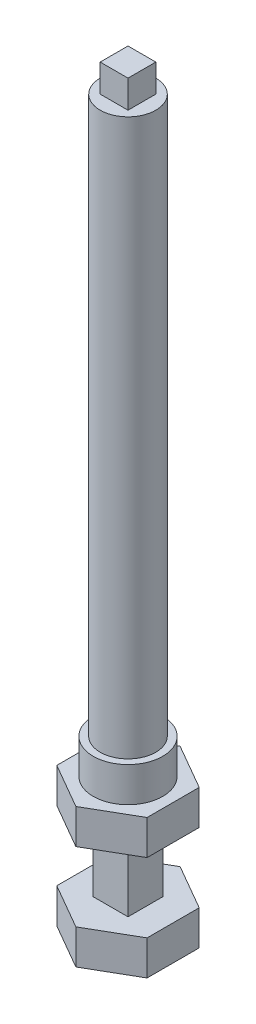
ISO-10303-21;
HEADER;
FILE_DESCRIPTION(('STEP AP214'),'2;1');
FILE_NAME('part.step','',(''),(''),'','','');
FILE_SCHEMA(('AUTOMOTIVE_DESIGN { 1 0 10303 214 1 1 1 1 }'));
ENDSEC;
DATA;
#1=APPLICATION_CONTEXT('core data for automotive mechanical design processes');
#2=APPLICATION_PROTOCOL_DEFINITION('international standard','automotive_design',2000,#1);
#3=PRODUCT_CONTEXT('',#1,'mechanical');
#4=PRODUCT('Part','Part','',(#3));
#5=PRODUCT_RELATED_PRODUCT_CATEGORY('part','',(#4));
#6=PRODUCT_DEFINITION_FORMATION('','',#4);
#7=PRODUCT_DEFINITION_CONTEXT('part definition',#1,'design');
#8=PRODUCT_DEFINITION('design','',#6,#7);
#9=PRODUCT_DEFINITION_SHAPE('','',#8);
#10=(LENGTH_UNIT() NAMED_UNIT(*) SI_UNIT(.MILLI.,.METRE.));
#11=(NAMED_UNIT(*) PLANE_ANGLE_UNIT() SI_UNIT($,.RADIAN.));
#12=(NAMED_UNIT(*) SI_UNIT($,.STERADIAN.) SOLID_ANGLE_UNIT());
#13=UNCERTAINTY_MEASURE_WITH_UNIT(LENGTH_MEASURE(1.E-05),#10,'distance_accuracy_value','');
#14=(GEOMETRIC_REPRESENTATION_CONTEXT(3) GLOBAL_UNCERTAINTY_ASSIGNED_CONTEXT((#13)) GLOBAL_UNIT_ASSIGNED_CONTEXT((#10,
#11,#12)) REPRESENTATION_CONTEXT('',''));
#15=CARTESIAN_POINT('',(0.,0.,0.));
#16=DIRECTION('',(0.,0.,1.));
#17=DIRECTION('',(1.,0.,0.));
#18=AXIS2_PLACEMENT_3D('',#15,#16,#17);
#19=CARTESIAN_POINT('',(-2.5,10.,2.5));
#20=DIRECTION('',(1.,0.,0.));
#21=DIRECTION('',(0.,0.,-1.));
#22=AXIS2_PLACEMENT_3D('',#19,#20,#21);
#23=PLANE('',#22);
#24=DIRECTION('',(0.,0.,1.));
#25=VECTOR('',#24,1.);
#26=CARTESIAN_POINT('',(-2.5,0.,2.5));
#27=LINE('',#26,#25);
#28=CARTESIAN_POINT('',(-2.5,0.,-2.5));
#29=VERTEX_POINT('',#28);
#30=CARTESIAN_POINT('',(-2.5,0.,2.5));
#31=VERTEX_POINT('',#30);
#32=EDGE_CURVE('E303',#29,#31,#27,.T.);
#33=ORIENTED_EDGE('',*,*,#32,.T.);
#34=DIRECTION('',(0.,-1.,0.));
#35=VECTOR('',#34,1.);
#36=CARTESIAN_POINT('',(-2.5,10.,2.5));
#37=LINE('',#36,#35);
#38=CARTESIAN_POINT('',(-2.5,10.,2.5));
#39=VERTEX_POINT('',#38);
#40=EDGE_CURVE('E47',#39,#31,#37,.T.);
#41=ORIENTED_EDGE('',*,*,#40,.F.);
#42=DIRECTION('',(0.,0.,1.));
#43=VECTOR('',#42,1.);
#44=CARTESIAN_POINT('',(-2.5,10.,2.5));
#45=LINE('',#44,#43);
#46=CARTESIAN_POINT('',(-2.5,10.,-2.5));
#47=VERTEX_POINT('',#46);
#48=EDGE_CURVE('E304',#47,#39,#45,.T.);
#49=ORIENTED_EDGE('',*,*,#48,.F.);
#50=DIRECTION('',(0.,-1.,0.));
#51=VECTOR('',#50,1.);
#52=CARTESIAN_POINT('',(-2.5,10.,-2.5));
#53=LINE('',#52,#51);
#54=EDGE_CURVE('E317',#47,#29,#53,.T.);
#55=ORIENTED_EDGE('',*,*,#54,.T.);
#56=EDGE_LOOP('',(#33,#41,#49,#55));
#57=FACE_BOUND('',#56,.T.);
#58=ADVANCED_FACE('F44',(#57),#23,.F.);
#59=CARTESIAN_POINT('',(2.5,10.,2.5));
#60=DIRECTION('',(0.,0.,-1.));
#61=DIRECTION('',(-1.,0.,0.));
#62=AXIS2_PLACEMENT_3D('',#59,#60,#61);
#63=PLANE('',#62);
#64=DIRECTION('',(1.,0.,0.));
#65=VECTOR('',#64,1.);
#66=CARTESIAN_POINT('',(2.5,0.,2.5));
#67=LINE('',#66,#65);
#68=CARTESIAN_POINT('',(2.5,0.,2.5));
#69=VERTEX_POINT('',#68);
#70=EDGE_CURVE('E320',#31,#69,#67,.T.);
#71=ORIENTED_EDGE('',*,*,#70,.T.);
#72=DIRECTION('',(0.,-1.,0.));
#73=VECTOR('',#72,1.);
#74=CARTESIAN_POINT('',(2.5,10.,2.5));
#75=LINE('',#74,#73);
#76=CARTESIAN_POINT('',(2.5,10.,2.5));
#77=VERTEX_POINT('',#76);
#78=EDGE_CURVE('E332',#77,#69,#75,.T.);
#79=ORIENTED_EDGE('',*,*,#78,.F.);
#80=DIRECTION('',(1.,0.,0.));
#81=VECTOR('',#80,1.);
#82=CARTESIAN_POINT('',(2.5,10.,2.5));
#83=LINE('',#82,#81);
#84=EDGE_CURVE('E307',#39,#77,#83,.T.);
#85=ORIENTED_EDGE('',*,*,#84,.F.);
#86=ORIENTED_EDGE('',*,*,#40,.T.);
#87=EDGE_LOOP('',(#71,#79,#85,#86));
#88=FACE_BOUND('',#87,.T.);
#89=ADVANCED_FACE('F339',(#88),#63,.F.);
#90=CARTESIAN_POINT('',(2.5,10.,2.5));
#91=DIRECTION('',(-1.,0.,0.));
#92=DIRECTION('',(0.,0.,1.));
#93=AXIS2_PLACEMENT_3D('',#90,#91,#92);
#94=PLANE('',#93);
#95=DIRECTION('',(0.,0.,-1.));
#96=VECTOR('',#95,1.);
#97=CARTESIAN_POINT('',(2.5,0.,2.5));
#98=LINE('',#97,#96);
#99=CARTESIAN_POINT('',(2.5,0.,-2.5));
#100=VERTEX_POINT('',#99);
#101=EDGE_CURVE('E323',#69,#100,#98,.T.);
#102=ORIENTED_EDGE('',*,*,#101,.T.);
#103=DIRECTION('',(0.,-1.,0.));
#104=VECTOR('',#103,1.);
#105=CARTESIAN_POINT('',(2.5,10.,-2.5));
#106=LINE('',#105,#104);
#107=CARTESIAN_POINT('',(2.5,10.,-2.5));
#108=VERTEX_POINT('',#107);
#109=EDGE_CURVE('E330',#108,#100,#106,.T.);
#110=ORIENTED_EDGE('',*,*,#109,.F.);
#111=DIRECTION('',(0.,0.,-1.));
#112=VECTOR('',#111,1.);
#113=CARTESIAN_POINT('',(2.5,10.,2.5));
#114=LINE('',#113,#112);
#115=EDGE_CURVE('E311',#77,#108,#114,.T.);
#116=ORIENTED_EDGE('',*,*,#115,.F.);
#117=ORIENTED_EDGE('',*,*,#78,.T.);
#118=EDGE_LOOP('',(#102,#110,#116,#117));
#119=FACE_BOUND('',#118,.T.);
#120=ADVANCED_FACE('F348',(#119),#94,.F.);
#121=CARTESIAN_POINT('',(2.5,10.,-2.5));
#122=DIRECTION('',(0.,0.,1.));
#123=DIRECTION('',(1.,0.,0.));
#124=AXIS2_PLACEMENT_3D('',#121,#122,#123);
#125=PLANE('',#124);
#126=DIRECTION('',(-1.,0.,0.));
#127=VECTOR('',#126,1.);
#128=CARTESIAN_POINT('',(2.5,0.,-2.5));
#129=LINE('',#128,#127);
#130=EDGE_CURVE('E308',#100,#29,#129,.T.);
#131=ORIENTED_EDGE('',*,*,#130,.T.);
#132=ORIENTED_EDGE('',*,*,#54,.F.);
#133=DIRECTION('',(-1.,0.,0.));
#134=VECTOR('',#133,1.);
#135=CARTESIAN_POINT('',(2.5,10.,-2.5));
#136=LINE('',#135,#134);
#137=EDGE_CURVE('E314',#108,#47,#136,.T.);
#138=ORIENTED_EDGE('',*,*,#137,.F.);
#139=ORIENTED_EDGE('',*,*,#109,.T.);
#140=EDGE_LOOP('',(#131,#132,#138,#139));
#141=FACE_BOUND('',#140,.T.);
#142=ADVANCED_FACE('F346',(#141),#125,.F.);
#143=CARTESIAN_POINT('',(6.49519052838328,-5.,3.75));
#144=DIRECTION('',(-0.5,0.,-0.866025403784439));
#145=DIRECTION('',(-0.866025403784439,0.,0.5));
#146=AXIS2_PLACEMENT_3D('',#143,#144,#145);
#147=PLANE('',#146);
#148=DIRECTION('',(-0.866025403784439,0.,0.5));
#149=VECTOR('',#148,1.);
#150=CARTESIAN_POINT('',(6.49519052838328,0.,3.75));
#151=LINE('',#150,#149);
#152=CARTESIAN_POINT('',(6.49519052838328,0.,3.75));
#153=VERTEX_POINT('',#152);
#154=CARTESIAN_POINT('',(0.,0.,7.5));
#155=VERTEX_POINT('',#154);
#156=EDGE_CURVE('E259',#153,#155,#151,.T.);
#157=ORIENTED_EDGE('',*,*,#156,.T.);
#158=DIRECTION('',(0.,1.,0.));
#159=VECTOR('',#158,1.);
#160=CARTESIAN_POINT('',(0.,-5.,7.5));
#161=LINE('',#160,#159);
#162=CARTESIAN_POINT('',(0.,-5.,7.5));
#163=VERTEX_POINT('',#162);
#164=EDGE_CURVE('E300',#163,#155,#161,.T.);
#165=ORIENTED_EDGE('',*,*,#164,.F.);
#166=DIRECTION('',(-0.866025403784439,0.,0.5));
#167=VECTOR('',#166,1.);
#168=CARTESIAN_POINT('',(6.49519052838328,-5.,3.75));
#169=LINE('',#168,#167);
#170=CARTESIAN_POINT('',(6.49519052838328,-5.,3.75));
#171=VERTEX_POINT('',#170);
#172=EDGE_CURVE('E260',#171,#163,#169,.T.);
#173=ORIENTED_EDGE('',*,*,#172,.F.);
#174=DIRECTION('',(0.,1.,0.));
#175=VECTOR('',#174,1.);
#176=CARTESIAN_POINT('',(6.49519052838328,-5.,3.75));
#177=LINE('',#176,#175);
#178=EDGE_CURVE('E274',#171,#153,#177,.T.);
#179=ORIENTED_EDGE('',*,*,#178,.T.);
#180=EDGE_LOOP('',(#157,#165,#173,#179));
#181=FACE_BOUND('',#180,.T.);
#182=ADVANCED_FACE('F378',(#181),#147,.F.);
#183=CARTESIAN_POINT('',(0.,-5.,7.5));
#184=DIRECTION('',(0.5,0.,-0.866025403784439));
#185=DIRECTION('',(-0.866025403784439,0.,-0.5));
#186=AXIS2_PLACEMENT_3D('',#183,#184,#185);
#187=PLANE('',#186);
#188=DIRECTION('',(-0.866025403784439,0.,-0.5));
#189=VECTOR('',#188,1.);
#190=CARTESIAN_POINT('',(0.,0.,7.5));
#191=LINE('',#190,#189);
#192=CARTESIAN_POINT('',(-6.49519052838329,0.,3.75));
#193=VERTEX_POINT('',#192);
#194=EDGE_CURVE('E277',#155,#193,#191,.T.);
#195=ORIENTED_EDGE('',*,*,#194,.T.);
#196=DIRECTION('',(0.,1.,0.));
#197=VECTOR('',#196,1.);
#198=CARTESIAN_POINT('',(-6.49519052838329,-5.,3.75));
#199=LINE('',#198,#197);
#200=CARTESIAN_POINT('',(-6.49519052838329,-5.,3.75));
#201=VERTEX_POINT('',#200);
#202=EDGE_CURVE('E297',#201,#193,#199,.T.);
#203=ORIENTED_EDGE('',*,*,#202,.F.);
#204=DIRECTION('',(-0.866025403784439,0.,-0.5));
#205=VECTOR('',#204,1.);
#206=CARTESIAN_POINT('',(0.,-5.,7.5));
#207=LINE('',#206,#205);
#208=EDGE_CURVE('E263',#163,#201,#207,.T.);
#209=ORIENTED_EDGE('',*,*,#208,.F.);
#210=ORIENTED_EDGE('',*,*,#164,.T.);
#211=EDGE_LOOP('',(#195,#203,#209,#210));
#212=FACE_BOUND('',#211,.T.);
#213=ADVANCED_FACE('F381',(#212),#187,.F.);
#214=CARTESIAN_POINT('',(-6.49519052838329,-5.,3.75));
#215=DIRECTION('',(1.,0.,0.));
#216=DIRECTION('',(0.,0.,-1.));
#217=AXIS2_PLACEMENT_3D('',#214,#215,#216);
#218=PLANE('',#217);
#219=DIRECTION('',(0.,0.,-1.));
#220=VECTOR('',#219,1.);
#221=CARTESIAN_POINT('',(-6.49519052838329,0.,3.75));
#222=LINE('',#221,#220);
#223=CARTESIAN_POINT('',(-6.49519052838329,0.,-3.75));
#224=VERTEX_POINT('',#223);
#225=EDGE_CURVE('E279',#193,#224,#222,.T.);
#226=ORIENTED_EDGE('',*,*,#225,.T.);
#227=DIRECTION('',(0.,1.,0.));
#228=VECTOR('',#227,1.);
#229=CARTESIAN_POINT('',(-6.49519052838329,-5.,-3.75));
#230=LINE('',#229,#228);
#231=CARTESIAN_POINT('',(-6.49519052838329,-5.,-3.75));
#232=VERTEX_POINT('',#231);
#233=EDGE_CURVE('E294',#232,#224,#230,.T.);
#234=ORIENTED_EDGE('',*,*,#233,.F.);
#235=DIRECTION('',(0.,0.,-1.));
#236=VECTOR('',#235,1.);
#237=CARTESIAN_POINT('',(-6.49519052838329,-5.,3.75));
#238=LINE('',#237,#236);
#239=EDGE_CURVE('E266',#201,#232,#238,.T.);
#240=ORIENTED_EDGE('',*,*,#239,.F.);
#241=ORIENTED_EDGE('',*,*,#202,.T.);
#242=EDGE_LOOP('',(#226,#234,#240,#241));
#243=FACE_BOUND('',#242,.T.);
#244=ADVANCED_FACE('F385',(#243),#218,.F.);
#245=CARTESIAN_POINT('',(-6.49519052838329,-5.,-3.75));
#246=DIRECTION('',(0.5,0.,0.866025403784439));
#247=DIRECTION('',(0.866025403784439,0.,-0.5));
#248=AXIS2_PLACEMENT_3D('',#245,#246,#247);
#249=PLANE('',#248);
#250=DIRECTION('',(0.866025403784439,0.,-0.5));
#251=VECTOR('',#250,1.);
#252=CARTESIAN_POINT('',(-6.49519052838329,0.,-3.75));
#253=LINE('',#252,#251);
#254=CARTESIAN_POINT('',(0.,0.,-7.5));
#255=VERTEX_POINT('',#254);
#256=EDGE_CURVE('E281',#224,#255,#253,.T.);
#257=ORIENTED_EDGE('',*,*,#256,.T.);
#258=DIRECTION('',(0.,1.,0.));
#259=VECTOR('',#258,1.);
#260=CARTESIAN_POINT('',(0.,-5.,-7.5));
#261=LINE('',#260,#259);
#262=CARTESIAN_POINT('',(0.,-5.,-7.5));
#263=VERTEX_POINT('',#262);
#264=EDGE_CURVE('E291',#263,#255,#261,.T.);
#265=ORIENTED_EDGE('',*,*,#264,.F.);
#266=DIRECTION('',(0.866025403784439,0.,-0.5));
#267=VECTOR('',#266,1.);
#268=CARTESIAN_POINT('',(-6.49519052838329,-5.,-3.75));
#269=LINE('',#268,#267);
#270=EDGE_CURVE('E268',#232,#263,#269,.T.);
#271=ORIENTED_EDGE('',*,*,#270,.F.);
#272=ORIENTED_EDGE('',*,*,#233,.T.);
#273=EDGE_LOOP('',(#257,#265,#271,#272));
#274=FACE_BOUND('',#273,.T.);
#275=ADVANCED_FACE('F389',(#274),#249,.F.);
#276=CARTESIAN_POINT('',(0.,-5.,-7.5));
#277=DIRECTION('',(-0.5,0.,0.866025403784439));
#278=DIRECTION('',(0.866025403784439,0.,0.5));
#279=AXIS2_PLACEMENT_3D('',#276,#277,#278);
#280=PLANE('',#279);
#281=DIRECTION('',(0.866025403784439,0.,0.5));
#282=VECTOR('',#281,1.);
#283=CARTESIAN_POINT('',(0.,0.,-7.5));
#284=LINE('',#283,#282);
#285=CARTESIAN_POINT('',(6.49519052838329,0.,-3.75));
#286=VERTEX_POINT('',#285);
#287=EDGE_CURVE('E283',#255,#286,#284,.T.);
#288=ORIENTED_EDGE('',*,*,#287,.T.);
#289=DIRECTION('',(0.,1.,0.));
#290=VECTOR('',#289,1.);
#291=CARTESIAN_POINT('',(6.49519052838329,-5.,-3.75));
#292=LINE('',#291,#290);
#293=CARTESIAN_POINT('',(6.49519052838329,-5.,-3.75));
#294=VERTEX_POINT('',#293);
#295=EDGE_CURVE('E288',#294,#286,#292,.T.);
#296=ORIENTED_EDGE('',*,*,#295,.F.);
#297=DIRECTION('',(0.866025403784439,0.,0.5));
#298=VECTOR('',#297,1.);
#299=CARTESIAN_POINT('',(0.,-5.,-7.5));
#300=LINE('',#299,#298);
#301=EDGE_CURVE('E270',#263,#294,#300,.T.);
#302=ORIENTED_EDGE('',*,*,#301,.F.);
#303=ORIENTED_EDGE('',*,*,#264,.T.);
#304=EDGE_LOOP('',(#288,#296,#302,#303));
#305=FACE_BOUND('',#304,.T.);
#306=ADVANCED_FACE('F393',(#305),#280,.F.);
#307=CARTESIAN_POINT('',(6.49519052838329,-5.,-3.75));
#308=DIRECTION('',(-1.,0.,0.));
#309=DIRECTION('',(0.,0.,1.));
#310=AXIS2_PLACEMENT_3D('',#307,#308,#309);
#311=PLANE('',#310);
#312=DIRECTION('',(0.,0.,1.));
#313=VECTOR('',#312,1.);
#314=CARTESIAN_POINT('',(6.49519052838329,0.,-3.75));
#315=LINE('',#314,#313);
#316=EDGE_CURVE('E264',#286,#153,#315,.T.);
#317=ORIENTED_EDGE('',*,*,#316,.T.);
#318=ORIENTED_EDGE('',*,*,#178,.F.);
#319=DIRECTION('',(0.,0.,1.));
#320=VECTOR('',#319,1.);
#321=CARTESIAN_POINT('',(6.49519052838329,-5.,-3.75));
#322=LINE('',#321,#320);
#323=EDGE_CURVE('E272',#294,#171,#322,.T.);
#324=ORIENTED_EDGE('',*,*,#323,.F.);
#325=ORIENTED_EDGE('',*,*,#295,.T.);
#326=EDGE_LOOP('',(#317,#318,#324,#325));
#327=FACE_BOUND('',#326,.T.);
#328=ADVANCED_FACE('F397',(#327),#311,.F.);
#329=CARTESIAN_POINT('',(0.,-5.,0.));
#330=DIRECTION('',(0.,-1.,0.));
#331=DIRECTION('',(0.,0.,-1.));
#332=AXIS2_PLACEMENT_3D('',#329,#330,#331);
#333=PLANE('',#332);
#334=ORIENTED_EDGE('',*,*,#172,.T.);
#335=ORIENTED_EDGE('',*,*,#208,.T.);
#336=ORIENTED_EDGE('',*,*,#239,.T.);
#337=ORIENTED_EDGE('',*,*,#270,.T.);
#338=ORIENTED_EDGE('',*,*,#301,.T.);
#339=ORIENTED_EDGE('',*,*,#323,.T.);
#340=EDGE_LOOP('',(#334,#335,#336,#337,#338,#339));
#341=FACE_BOUND('',#340,.T.);
#342=ADVANCED_FACE('F362',(#341),#333,.T.);
#343=CARTESIAN_POINT('',(0.,0.,0.));
#344=DIRECTION('',(0.,-1.,0.));
#345=DIRECTION('',(0.,0.,-1.));
#346=AXIS2_PLACEMENT_3D('',#343,#344,#345);
#347=PLANE('',#346);
#348=ORIENTED_EDGE('',*,*,#32,.F.);
#349=ORIENTED_EDGE('',*,*,#130,.F.);
#350=ORIENTED_EDGE('',*,*,#101,.F.);
#351=ORIENTED_EDGE('',*,*,#70,.F.);
#352=EDGE_LOOP('',(#348,#349,#350,#351));
#353=FACE_BOUND('',#352,.T.);
#354=ORIENTED_EDGE('',*,*,#156,.F.);
#355=ORIENTED_EDGE('',*,*,#316,.F.);
#356=ORIENTED_EDGE('',*,*,#287,.F.);
#357=ORIENTED_EDGE('',*,*,#256,.F.);
#358=ORIENTED_EDGE('',*,*,#225,.F.);
#359=ORIENTED_EDGE('',*,*,#194,.F.);
#360=EDGE_LOOP('',(#354,#355,#356,#357,#358,#359));
#361=FACE_BOUND('',#360,.T.);
#362=ADVANCED_FACE('F343',(#353,#361),#347,.F.);
#363=CARTESIAN_POINT('',(0.,10.,0.));
#364=DIRECTION('',(0.,1.,0.));
#365=DIRECTION('',(0.,0.,1.));
#366=AXIS2_PLACEMENT_3D('',#363,#364,#365);
#367=PLANE('',#366);
#368=DIRECTION('',(0.866025403784439,0.,0.5));
#369=VECTOR('',#368,1.);
#370=CARTESIAN_POINT('',(-6.49519052838329,10.,3.75));
#371=LINE('',#370,#369);
#372=CARTESIAN_POINT('',(-6.49519052838329,10.,3.75));
#373=VERTEX_POINT('',#372);
#374=CARTESIAN_POINT('',(0.,10.,7.5));
#375=VERTEX_POINT('',#374);
#376=EDGE_CURVE('E213',#373,#375,#371,.T.);
#377=ORIENTED_EDGE('',*,*,#376,.F.);
#378=DIRECTION('',(0.,0.,1.));
#379=VECTOR('',#378,1.);
#380=CARTESIAN_POINT('',(-6.49519052838329,10.,-3.75));
#381=LINE('',#380,#379);
#382=CARTESIAN_POINT('',(-6.49519052838329,10.,-3.75));
#383=VERTEX_POINT('',#382);
#384=EDGE_CURVE('E220',#383,#373,#381,.T.);
#385=ORIENTED_EDGE('',*,*,#384,.F.);
#386=DIRECTION('',(-0.866025403784439,0.,0.5));
#387=VECTOR('',#386,1.);
#388=CARTESIAN_POINT('',(0.,10.,-7.5));
#389=LINE('',#388,#387);
#390=CARTESIAN_POINT('',(0.,10.,-7.5));
#391=VERTEX_POINT('',#390);
#392=EDGE_CURVE('E239',#391,#383,#389,.T.);
#393=ORIENTED_EDGE('',*,*,#392,.F.);
#394=DIRECTION('',(-0.866025403784439,0.,-0.5));
#395=VECTOR('',#394,1.);
#396=CARTESIAN_POINT('',(6.49519052838329,10.,-3.75));
#397=LINE('',#396,#395);
#398=CARTESIAN_POINT('',(6.49519052838329,10.,-3.75));
#399=VERTEX_POINT('',#398);
#400=EDGE_CURVE('E237',#399,#391,#397,.T.);
#401=ORIENTED_EDGE('',*,*,#400,.F.);
#402=DIRECTION('',(0.,0.,-1.));
#403=VECTOR('',#402,1.);
#404=CARTESIAN_POINT('',(6.49519052838328,10.,3.75));
#405=LINE('',#404,#403);
#406=CARTESIAN_POINT('',(6.49519052838328,10.,3.75));
#407=VERTEX_POINT('',#406);
#408=EDGE_CURVE('E235',#407,#399,#405,.T.);
#409=ORIENTED_EDGE('',*,*,#408,.F.);
#410=DIRECTION('',(0.866025403784439,0.,-0.5));
#411=VECTOR('',#410,1.);
#412=CARTESIAN_POINT('',(0.,10.,7.5));
#413=LINE('',#412,#411);
#414=EDGE_CURVE('E233',#375,#407,#413,.T.);
#415=ORIENTED_EDGE('',*,*,#414,.F.);
#416=EDGE_LOOP('',(#377,#385,#393,#401,#409,#415));
#417=FACE_BOUND('',#416,.T.);
#418=ORIENTED_EDGE('',*,*,#137,.T.);
#419=ORIENTED_EDGE('',*,*,#48,.T.);
#420=ORIENTED_EDGE('',*,*,#84,.T.);
#421=ORIENTED_EDGE('',*,*,#115,.T.);
#422=EDGE_LOOP('',(#418,#419,#420,#421));
#423=FACE_BOUND('',#422,.T.);
#424=ADVANCED_FACE('F350',(#417,#423),#367,.F.);
#425=CARTESIAN_POINT('',(-6.49519052838329,15.,3.75));
#426=DIRECTION('',(0.5,0.,-0.866025403784439));
#427=DIRECTION('',(-0.866025403784439,0.,-0.5));
#428=AXIS2_PLACEMENT_3D('',#425,#426,#427);
#429=PLANE('',#428);
#430=ORIENTED_EDGE('',*,*,#376,.T.);
#431=DIRECTION('',(0.,-1.,0.));
#432=VECTOR('',#431,1.);
#433=CARTESIAN_POINT('',(0.,15.,7.5));
#434=LINE('',#433,#432);
#435=CARTESIAN_POINT('',(0.,15.,7.5));
#436=VERTEX_POINT('',#435);
#437=EDGE_CURVE('E256',#436,#375,#434,.T.);
#438=ORIENTED_EDGE('',*,*,#437,.F.);
#439=DIRECTION('',(0.866025403784439,0.,0.5));
#440=VECTOR('',#439,1.);
#441=CARTESIAN_POINT('',(-6.49519052838329,15.,3.75));
#442=LINE('',#441,#440);
#443=CARTESIAN_POINT('',(-6.49519052838329,15.,3.75));
#444=VERTEX_POINT('',#443);
#445=EDGE_CURVE('E216',#444,#436,#442,.T.);
#446=ORIENTED_EDGE('',*,*,#445,.F.);
#447=DIRECTION('',(0.,-1.,0.));
#448=VECTOR('',#447,1.);
#449=CARTESIAN_POINT('',(-6.49519052838329,15.,3.75));
#450=LINE('',#449,#448);
#451=EDGE_CURVE('E230',#444,#373,#450,.T.);
#452=ORIENTED_EDGE('',*,*,#451,.T.);
#453=EDGE_LOOP('',(#430,#438,#446,#452));
#454=FACE_BOUND('',#453,.T.);
#455=ADVANCED_FACE('F352',(#454),#429,.F.);
#456=CARTESIAN_POINT('',(0.,15.,7.5));
#457=DIRECTION('',(-0.5,0.,-0.866025403784439));
#458=DIRECTION('',(-0.866025403784439,0.,0.5));
#459=AXIS2_PLACEMENT_3D('',#456,#457,#458);
#460=PLANE('',#459);
#461=ORIENTED_EDGE('',*,*,#414,.T.);
#462=DIRECTION('',(0.,-1.,0.));
#463=VECTOR('',#462,1.);
#464=CARTESIAN_POINT('',(6.49519052838328,15.,3.75));
#465=LINE('',#464,#463);
#466=CARTESIAN_POINT('',(6.49519052838328,15.,3.75));
#467=VERTEX_POINT('',#466);
#468=EDGE_CURVE('E253',#467,#407,#465,.T.);
#469=ORIENTED_EDGE('',*,*,#468,.F.);
#470=DIRECTION('',(0.866025403784439,0.,-0.5));
#471=VECTOR('',#470,1.);
#472=CARTESIAN_POINT('',(0.,15.,7.5));
#473=LINE('',#472,#471);
#474=EDGE_CURVE('E219',#436,#467,#473,.T.);
#475=ORIENTED_EDGE('',*,*,#474,.F.);
#476=ORIENTED_EDGE('',*,*,#437,.T.);
#477=EDGE_LOOP('',(#461,#469,#475,#476));
#478=FACE_BOUND('',#477,.T.);
#479=ADVANCED_FACE('F359',(#478),#460,.F.);
#480=CARTESIAN_POINT('',(6.49519052838328,15.,3.75));
#481=DIRECTION('',(-1.,0.,0.));
#482=DIRECTION('',(0.,0.,1.));
#483=AXIS2_PLACEMENT_3D('',#480,#481,#482);
#484=PLANE('',#483);
#485=ORIENTED_EDGE('',*,*,#408,.T.);
#486=DIRECTION('',(0.,-1.,0.));
#487=VECTOR('',#486,1.);
#488=CARTESIAN_POINT('',(6.49519052838329,15.,-3.75));
#489=LINE('',#488,#487);
#490=CARTESIAN_POINT('',(6.49519052838329,15.,-3.75));
#491=VERTEX_POINT('',#490);
#492=EDGE_CURVE('E250',#491,#399,#489,.T.);
#493=ORIENTED_EDGE('',*,*,#492,.F.);
#494=DIRECTION('',(0.,0.,-1.));
#495=VECTOR('',#494,1.);
#496=CARTESIAN_POINT('',(6.49519052838328,15.,3.75));
#497=LINE('',#496,#495);
#498=EDGE_CURVE('E222',#467,#491,#497,.T.);
#499=ORIENTED_EDGE('',*,*,#498,.F.);
#500=ORIENTED_EDGE('',*,*,#468,.T.);
#501=EDGE_LOOP('',(#485,#493,#499,#500));
#502=FACE_BOUND('',#501,.T.);
#503=ADVANCED_FACE('F407',(#502),#484,.F.);
#504=CARTESIAN_POINT('',(6.49519052838329,15.,-3.75));
#505=DIRECTION('',(-0.5,0.,0.866025403784439));
#506=DIRECTION('',(0.866025403784439,0.,0.5));
#507=AXIS2_PLACEMENT_3D('',#504,#505,#506);
#508=PLANE('',#507);
#509=ORIENTED_EDGE('',*,*,#400,.T.);
#510=DIRECTION('',(0.,-1.,0.));
#511=VECTOR('',#510,1.);
#512=CARTESIAN_POINT('',(0.,15.,-7.5));
#513=LINE('',#512,#511);
#514=CARTESIAN_POINT('',(0.,15.,-7.5));
#515=VERTEX_POINT('',#514);
#516=EDGE_CURVE('E247',#515,#391,#513,.T.);
#517=ORIENTED_EDGE('',*,*,#516,.F.);
#518=DIRECTION('',(-0.866025403784439,0.,-0.5));
#519=VECTOR('',#518,1.);
#520=CARTESIAN_POINT('',(6.49519052838329,15.,-3.75));
#521=LINE('',#520,#519);
#522=EDGE_CURVE('E224',#491,#515,#521,.T.);
#523=ORIENTED_EDGE('',*,*,#522,.F.);
#524=ORIENTED_EDGE('',*,*,#492,.T.);
#525=EDGE_LOOP('',(#509,#517,#523,#524));
#526=FACE_BOUND('',#525,.T.);
#527=ADVANCED_FACE('F411',(#526),#508,.F.);
#528=CARTESIAN_POINT('',(0.,15.,-7.5));
#529=DIRECTION('',(0.5,0.,0.866025403784439));
#530=DIRECTION('',(0.866025403784439,0.,-0.5));
#531=AXIS2_PLACEMENT_3D('',#528,#529,#530);
#532=PLANE('',#531);
#533=ORIENTED_EDGE('',*,*,#392,.T.);
#534=DIRECTION('',(0.,-1.,0.));
#535=VECTOR('',#534,1.);
#536=CARTESIAN_POINT('',(-6.49519052838329,15.,-3.75));
#537=LINE('',#536,#535);
#538=CARTESIAN_POINT('',(-6.49519052838329,15.,-3.75));
#539=VERTEX_POINT('',#538);
#540=EDGE_CURVE('E244',#539,#383,#537,.T.);
#541=ORIENTED_EDGE('',*,*,#540,.F.);
#542=DIRECTION('',(-0.866025403784439,0.,0.5));
#543=VECTOR('',#542,1.);
#544=CARTESIAN_POINT('',(0.,15.,-7.5));
#545=LINE('',#544,#543);
#546=EDGE_CURVE('E226',#515,#539,#545,.T.);
#547=ORIENTED_EDGE('',*,*,#546,.F.);
#548=ORIENTED_EDGE('',*,*,#516,.T.);
#549=EDGE_LOOP('',(#533,#541,#547,#548));
#550=FACE_BOUND('',#549,.T.);
#551=ADVANCED_FACE('F415',(#550),#532,.F.);
#552=CARTESIAN_POINT('',(-6.49519052838329,15.,-3.75));
#553=DIRECTION('',(1.,0.,0.));
#554=DIRECTION('',(0.,0.,-1.));
#555=AXIS2_PLACEMENT_3D('',#552,#553,#554);
#556=PLANE('',#555);
#557=ORIENTED_EDGE('',*,*,#384,.T.);
#558=ORIENTED_EDGE('',*,*,#451,.F.);
#559=DIRECTION('',(0.,0.,1.));
#560=VECTOR('',#559,1.);
#561=CARTESIAN_POINT('',(-6.49519052838329,15.,-3.75));
#562=LINE('',#561,#560);
#563=EDGE_CURVE('E228',#539,#444,#562,.T.);
#564=ORIENTED_EDGE('',*,*,#563,.F.);
#565=ORIENTED_EDGE('',*,*,#540,.T.);
#566=EDGE_LOOP('',(#557,#558,#564,#565));
#567=FACE_BOUND('',#566,.T.);
#568=ADVANCED_FACE('F418',(#567),#556,.F.);
#569=CARTESIAN_POINT('',(0.,15.,0.));
#570=DIRECTION('',(0.,1.,0.));
#571=DIRECTION('',(0.,0.,1.));
#572=AXIS2_PLACEMENT_3D('',#569,#570,#571);
#573=PLANE('',#572);
#574=CARTESIAN_POINT('',(0.,15.,0.));
#575=DIRECTION('',(0.,1.,0.));
#576=DIRECTION('',(0.,0.,1.));
#577=AXIS2_PLACEMENT_3D('',#574,#575,#576);
#578=CIRCLE('',#577,5.);
#579=CARTESIAN_POINT('',(0.,15.,5.));
#580=VERTEX_POINT('',#579);
#581=EDGE_CURVE('E52',#580,#580,#578,.T.);
#582=ORIENTED_EDGE('',*,*,#581,.F.);
#583=EDGE_LOOP('',(#582));
#584=FACE_BOUND('',#583,.T.);
#585=ORIENTED_EDGE('',*,*,#445,.T.);
#586=ORIENTED_EDGE('',*,*,#474,.T.);
#587=ORIENTED_EDGE('',*,*,#498,.T.);
#588=ORIENTED_EDGE('',*,*,#522,.T.);
#589=ORIENTED_EDGE('',*,*,#546,.T.);
#590=ORIENTED_EDGE('',*,*,#563,.T.);
#591=EDGE_LOOP('',(#585,#586,#587,#588,#589,#590));
#592=FACE_BOUND('',#591,.T.);
#593=ADVANCED_FACE('F421',(#584,#592),#573,.T.);
#594=CARTESIAN_POINT('',(0.,20.,0.));
#595=DIRECTION('',(0.,-1.,0.));
#596=DIRECTION('',(0.,0.,-1.));
#597=AXIS2_PLACEMENT_3D('',#594,#595,#596);
#598=CYLINDRICAL_SURFACE('',#597,5.);
#599=CARTESIAN_POINT('',(0.,20.,0.));
#600=DIRECTION('',(0.,1.,0.));
#601=DIRECTION('',(0.,0.,1.));
#602=AXIS2_PLACEMENT_3D('',#599,#600,#601);
#603=CIRCLE('',#602,5.);
#604=CARTESIAN_POINT('',(0.,20.,5.));
#605=VERTEX_POINT('',#604);
#606=EDGE_CURVE('E205',#605,#605,#603,.T.);
#607=ORIENTED_EDGE('',*,*,#606,.F.);
#608=EDGE_LOOP('',(#607));
#609=FACE_BOUND('',#608,.T.);
#610=ORIENTED_EDGE('',*,*,#581,.T.);
#611=EDGE_LOOP('',(#610));
#612=FACE_BOUND('',#611,.T.);
#613=ADVANCED_FACE('F426',(#609,#612),#598,.T.);
#614=CARTESIAN_POINT('',(0.,20.,0.));
#615=DIRECTION('',(0.,1.,0.));
#616=DIRECTION('',(0.,0.,1.));
#617=AXIS2_PLACEMENT_3D('',#614,#615,#616);
#618=PLANE('',#617);
#619=CARTESIAN_POINT('',(0.,20.,0.));
#620=DIRECTION('',(0.,1.,0.));
#621=DIRECTION('',(0.,0.,1.));
#622=AXIS2_PLACEMENT_3D('',#619,#620,#621);
#623=CIRCLE('',#622,4.);
#624=CARTESIAN_POINT('',(0.,20.,4.));
#625=VERTEX_POINT('',#624);
#626=EDGE_CURVE('E12',#625,#625,#623,.T.);
#627=ORIENTED_EDGE('',*,*,#626,.F.);
#628=EDGE_LOOP('',(#627));
#629=FACE_BOUND('',#628,.T.);
#630=ORIENTED_EDGE('',*,*,#606,.T.);
#631=EDGE_LOOP('',(#630));
#632=FACE_BOUND('',#631,.T.);
#633=ADVANCED_FACE('F447',(#629,#632),#618,.T.);
#634=CARTESIAN_POINT('',(0.,201.313708498985,0.));
#635=DIRECTION('',(0.,-1.,0.));
#636=DIRECTION('',(0.,0.,-1.));
#637=AXIS2_PLACEMENT_3D('',#634,#635,#636);
#638=CYLINDRICAL_SURFACE('',#637,4.);
#639=ORIENTED_EDGE('',*,*,#626,.T.);
#640=EDGE_LOOP('',(#639));
#641=FACE_BOUND('',#640,.T.);
#642=CARTESIAN_POINT('',(0.,100.,0.));
#643=DIRECTION('',(0.,1.,0.));
#644=DIRECTION('',(0.,0.,1.));
#645=AXIS2_PLACEMENT_3D('',#642,#643,#644);
#646=CIRCLE('',#645,4.);
#647=CARTESIAN_POINT('',(0.,100.,4.));
#648=VERTEX_POINT('',#647);
#649=EDGE_CURVE('E202',#648,#648,#646,.T.);
#650=ORIENTED_EDGE('',*,*,#649,.F.);
#651=EDGE_LOOP('',(#650));
#652=FACE_BOUND('',#651,.T.);
#653=ADVANCED_FACE('F454',(#641,#652),#638,.T.);
#654=CARTESIAN_POINT('',(0.,100.,0.));
#655=DIRECTION('',(0.,1.,0.));
#656=DIRECTION('',(0.,0.,1.));
#657=AXIS2_PLACEMENT_3D('',#654,#655,#656);
#658=PLANE('',#657);
#659=DIRECTION('',(0.,0.,1.));
#660=VECTOR('',#659,1.);
#661=CARTESIAN_POINT('',(-2.,100.,2.));
#662=LINE('',#661,#660);
#663=CARTESIAN_POINT('',(-2.,100.,-2.));
#664=VERTEX_POINT('',#663);
#665=CARTESIAN_POINT('',(-2.,100.,2.));
#666=VERTEX_POINT('',#665);
#667=EDGE_CURVE('E60',#664,#666,#662,.T.);
#668=ORIENTED_EDGE('',*,*,#667,.F.);
#669=DIRECTION('',(-1.,0.,0.));
#670=VECTOR('',#669,1.);
#671=CARTESIAN_POINT('',(2.,100.,-2.));
#672=LINE('',#671,#670);
#673=CARTESIAN_POINT('',(2.,100.,-2.));
#674=VERTEX_POINT('',#673);
#675=EDGE_CURVE('E64',#674,#664,#672,.T.);
#676=ORIENTED_EDGE('',*,*,#675,.F.);
#677=DIRECTION('',(0.,0.,-1.));
#678=VECTOR('',#677,1.);
#679=CARTESIAN_POINT('',(2.,100.,2.));
#680=LINE('',#679,#678);
#681=CARTESIAN_POINT('',(2.,100.,2.));
#682=VERTEX_POINT('',#681);
#683=EDGE_CURVE('E758',#682,#674,#680,.T.);
#684=ORIENTED_EDGE('',*,*,#683,.F.);
#685=DIRECTION('',(1.,0.,0.));
#686=VECTOR('',#685,1.);
#687=CARTESIAN_POINT('',(2.,100.,2.));
#688=LINE('',#687,#686);
#689=EDGE_CURVE('E764',#666,#682,#688,.T.);
#690=ORIENTED_EDGE('',*,*,#689,.F.);
#691=EDGE_LOOP('',(#668,#676,#684,#690));
#692=FACE_BOUND('',#691,.T.);
#693=ORIENTED_EDGE('',*,*,#649,.T.);
#694=EDGE_LOOP('',(#693));
#695=FACE_BOUND('',#694,.T.);
#696=ADVANCED_FACE('F456',(#692,#695),#658,.T.);
#697=CARTESIAN_POINT('',(-2.,104.,2.));
#698=DIRECTION('',(1.,0.,0.));
#699=DIRECTION('',(0.,0.,-1.));
#700=AXIS2_PLACEMENT_3D('',#697,#698,#699);
#701=PLANE('',#700);
#702=ORIENTED_EDGE('',*,*,#667,.T.);
#703=DIRECTION('',(0.,-1.,0.));
#704=VECTOR('',#703,1.);
#705=CARTESIAN_POINT('',(-2.,104.,2.));
#706=LINE('',#705,#704);
#707=CARTESIAN_POINT('',(-2.,104.,2.));
#708=VERTEX_POINT('',#707);
#709=EDGE_CURVE('E185',#708,#666,#706,.T.);
#710=ORIENTED_EDGE('',*,*,#709,.F.);
#711=DIRECTION('',(0.,0.,1.));
#712=VECTOR('',#711,1.);
#713=CARTESIAN_POINT('',(-2.,104.,2.));
#714=LINE('',#713,#712);
#715=CARTESIAN_POINT('',(-2.,104.,-2.));
#716=VERTEX_POINT('',#715);
#717=EDGE_CURVE('E191',#716,#708,#714,.T.);
#718=ORIENTED_EDGE('',*,*,#717,.F.);
#719=DIRECTION('',(0.,-1.,0.));
#720=VECTOR('',#719,1.);
#721=CARTESIAN_POINT('',(-2.,104.,-2.));
#722=LINE('',#721,#720);
#723=EDGE_CURVE('E756',#716,#664,#722,.T.);
#724=ORIENTED_EDGE('',*,*,#723,.T.);
#725=EDGE_LOOP('',(#702,#710,#718,#724));
#726=FACE_BOUND('',#725,.T.);
#727=ADVANCED_FACE('F201',(#726),#701,.F.);
#728=CARTESIAN_POINT('',(2.,104.,2.));
#729=DIRECTION('',(0.,0.,-1.));
#730=DIRECTION('',(-1.,0.,0.));
#731=AXIS2_PLACEMENT_3D('',#728,#729,#730);
#732=PLANE('',#731);
#733=ORIENTED_EDGE('',*,*,#689,.T.);
#734=DIRECTION('',(0.,-1.,0.));
#735=VECTOR('',#734,1.);
#736=CARTESIAN_POINT('',(2.,104.,2.));
#737=LINE('',#736,#735);
#738=CARTESIAN_POINT('',(2.,104.,2.));
#739=VERTEX_POINT('',#738);
#740=EDGE_CURVE('E187',#739,#682,#737,.T.);
#741=ORIENTED_EDGE('',*,*,#740,.F.);
#742=DIRECTION('',(1.,0.,0.));
#743=VECTOR('',#742,1.);
#744=CARTESIAN_POINT('',(2.,104.,2.));
#745=LINE('',#744,#743);
#746=EDGE_CURVE('E180',#708,#739,#745,.T.);
#747=ORIENTED_EDGE('',*,*,#746,.F.);
#748=ORIENTED_EDGE('',*,*,#709,.T.);
#749=EDGE_LOOP('',(#733,#741,#747,#748));
#750=FACE_BOUND('',#749,.T.);
#751=ADVANCED_FACE('F183',(#750),#732,.F.);
#752=CARTESIAN_POINT('',(2.,104.,2.));
#753=DIRECTION('',(-1.,0.,0.));
#754=DIRECTION('',(0.,0.,1.));
#755=AXIS2_PLACEMENT_3D('',#752,#753,#754);
#756=PLANE('',#755);
#757=ORIENTED_EDGE('',*,*,#683,.T.);
#758=DIRECTION('',(0.,-1.,0.));
#759=VECTOR('',#758,1.);
#760=CARTESIAN_POINT('',(2.,104.,-2.));
#761=LINE('',#760,#759);
#762=CARTESIAN_POINT('',(2.,104.,-2.));
#763=VERTEX_POINT('',#762);
#764=EDGE_CURVE('E207',#763,#674,#761,.T.);
#765=ORIENTED_EDGE('',*,*,#764,.F.);
#766=DIRECTION('',(0.,0.,-1.));
#767=VECTOR('',#766,1.);
#768=CARTESIAN_POINT('',(2.,104.,2.));
#769=LINE('',#768,#767);
#770=EDGE_CURVE('E190',#739,#763,#769,.T.);
#771=ORIENTED_EDGE('',*,*,#770,.F.);
#772=ORIENTED_EDGE('',*,*,#740,.T.);
#773=EDGE_LOOP('',(#757,#765,#771,#772));
#774=FACE_BOUND('',#773,.T.);
#775=ADVANCED_FACE('F466',(#774),#756,.F.);
#776=CARTESIAN_POINT('',(2.,104.,-2.));
#777=DIRECTION('',(0.,0.,1.));
#778=DIRECTION('',(1.,0.,0.));
#779=AXIS2_PLACEMENT_3D('',#776,#777,#778);
#780=PLANE('',#779);
#781=ORIENTED_EDGE('',*,*,#675,.T.);
#782=ORIENTED_EDGE('',*,*,#723,.F.);
#783=DIRECTION('',(-1.,0.,0.));
#784=VECTOR('',#783,1.);
#785=CARTESIAN_POINT('',(2.,104.,-2.));
#786=LINE('',#785,#784);
#787=EDGE_CURVE('E196',#763,#716,#786,.T.);
#788=ORIENTED_EDGE('',*,*,#787,.F.);
#789=ORIENTED_EDGE('',*,*,#764,.T.);
#790=EDGE_LOOP('',(#781,#782,#788,#789));
#791=FACE_BOUND('',#790,.T.);
#792=ADVANCED_FACE('F469',(#791),#780,.F.);
#793=CARTESIAN_POINT('',(0.,104.,0.));
#794=DIRECTION('',(0.,1.,0.));
#795=DIRECTION('',(0.,0.,1.));
#796=AXIS2_PLACEMENT_3D('',#793,#794,#795);
#797=PLANE('',#796);
#798=ORIENTED_EDGE('',*,*,#717,.T.);
#799=ORIENTED_EDGE('',*,*,#746,.T.);
#800=ORIENTED_EDGE('',*,*,#770,.T.);
#801=ORIENTED_EDGE('',*,*,#787,.T.);
#802=EDGE_LOOP('',(#798,#799,#800,#801));
#803=FACE_BOUND('',#802,.T.);
#804=ADVANCED_FACE('F194',(#803),#797,.T.);
#805=CLOSED_SHELL('',(#58,#89,#120,#142,#182,#213,#244,#275,#306,#328,#342,#362,#424,#455,#479,
#503,#527,#551,#568,#593,#613,#633,#653,#696,#727,#751,#775,#792,#804));
#806=MANIFOLD_SOLID_BREP('B2',#805);
#807=ADVANCED_BREP_SHAPE_REPRESENTATION('',(#18,#806),#14);
#808=SHAPE_DEFINITION_REPRESENTATION(#9,#807);
ENDSEC;
END-ISO-10303-21;
